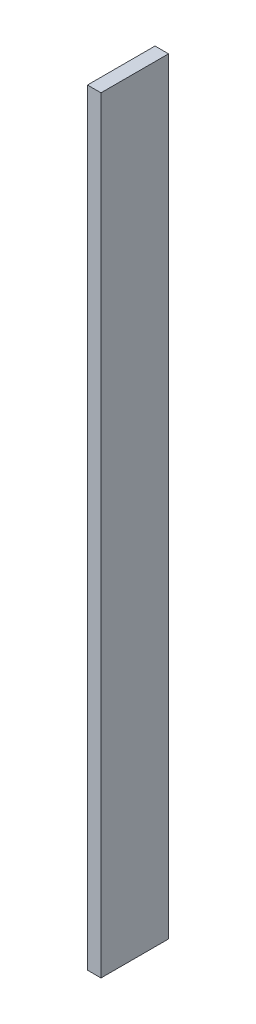
ISO-10303-21;
HEADER;
FILE_DESCRIPTION(('STEP AP214'),'2;1');
FILE_NAME('part.step','',(''),(''),'','','');
FILE_SCHEMA(('AUTOMOTIVE_DESIGN { 1 0 10303 214 1 1 1 1 }'));
ENDSEC;
DATA;
#1=APPLICATION_CONTEXT('core data for automotive mechanical design processes');
#2=APPLICATION_PROTOCOL_DEFINITION('international standard','automotive_design',2000,#1);
#3=PRODUCT_CONTEXT('',#1,'mechanical');
#4=PRODUCT('Part','Part','',(#3));
#5=PRODUCT_RELATED_PRODUCT_CATEGORY('part','',(#4));
#6=PRODUCT_DEFINITION_FORMATION('','',#4);
#7=PRODUCT_DEFINITION_CONTEXT('part definition',#1,'design');
#8=PRODUCT_DEFINITION('design','',#6,#7);
#9=PRODUCT_DEFINITION_SHAPE('','',#8);
#10=(LENGTH_UNIT() NAMED_UNIT(*) SI_UNIT(.MILLI.,.METRE.));
#11=(NAMED_UNIT(*) PLANE_ANGLE_UNIT() SI_UNIT($,.RADIAN.));
#12=(NAMED_UNIT(*) SI_UNIT($,.STERADIAN.) SOLID_ANGLE_UNIT());
#13=UNCERTAINTY_MEASURE_WITH_UNIT(LENGTH_MEASURE(1.E-05),#10,'distance_accuracy_value','');
#14=(GEOMETRIC_REPRESENTATION_CONTEXT(3) GLOBAL_UNCERTAINTY_ASSIGNED_CONTEXT((#13)) GLOBAL_UNIT_ASSIGNED_CONTEXT((#10,
#11,#12)) REPRESENTATION_CONTEXT('',''));
#15=CARTESIAN_POINT('',(0.,0.,0.));
#16=DIRECTION('',(0.,0.,1.));
#17=DIRECTION('',(1.,0.,0.));
#18=AXIS2_PLACEMENT_3D('',#15,#16,#17);
#19=CARTESIAN_POINT('',(-52.4875591164432,-34.0495234631935,0.));
#20=DIRECTION('',(0.,0.,-1.));
#21=DIRECTION('',(0.707106781186549,0.707106781186547,0.));
#22=AXIS2_PLACEMENT_3D('',#19,#20,#21);
#23=PLANE('',#22);
#24=DIRECTION('',(0.,-1.,0.));
#25=VECTOR('',#24,1.);
#26=CARTESIAN_POINT('',(-54.7219136914939,-33.4553943449556,0.));
#27=LINE('',#26,#25);
#28=CARTESIAN_POINT('',(-54.7219136914939,21.7746056550446,0.));
#29=VERTEX_POINT('',#28);
#30=CARTESIAN_POINT('',(-54.7219136914938,-91.7253943449556,0.));
#31=VERTEX_POINT('',#30);
#32=EDGE_CURVE('E51',#29,#31,#27,.T.);
#33=ORIENTED_EDGE('',*,*,#32,.F.);
#34=DIRECTION('',(1.,0.,0.));
#35=VECTOR('',#34,1.);
#36=CARTESIAN_POINT('',(-54.7219136914939,21.7746056550446,0.));
#37=LINE('',#36,#35);
#38=CARTESIAN_POINT('',(-52.7218736914939,21.7746056550446,0.));
#39=VERTEX_POINT('',#38);
#40=EDGE_CURVE('E109',#29,#39,#37,.T.);
#41=ORIENTED_EDGE('',*,*,#40,.T.);
#42=DIRECTION('',(0.,-1.,0.));
#43=VECTOR('',#42,1.);
#44=CARTESIAN_POINT('',(-52.7218736914939,-33.4553943449556,0.));
#45=LINE('',#44,#43);
#46=CARTESIAN_POINT('',(-52.7218736914938,-91.7253943449555,0.));
#47=VERTEX_POINT('',#46);
#48=EDGE_CURVE('E77',#39,#47,#45,.T.);
#49=ORIENTED_EDGE('',*,*,#48,.T.);
#50=DIRECTION('',(-1.,0.,0.));
#51=VECTOR('',#50,1.);
#52=CARTESIAN_POINT('',(-52.7218736914938,-91.7253943449555,0.));
#53=LINE('',#52,#51);
#54=EDGE_CURVE('E102',#47,#31,#53,.T.);
#55=ORIENTED_EDGE('',*,*,#54,.T.);
#56=EDGE_LOOP('',(#33,#41,#49,#55));
#57=FACE_BOUND('',#56,.T.);
#58=ADVANCED_FACE('F47',(#57),#23,.T.);
#59=CARTESIAN_POINT('',(-51.3561882665447,-57.2611852267176,10.));
#60=DIRECTION('',(0.,0.,1.));
#61=DIRECTION('',(-0.707106781186549,-0.707106781186547,0.));
#62=AXIS2_PLACEMENT_3D('',#59,#60,#61);
#63=PLANE('',#62);
#64=DIRECTION('',(0.,-1.,0.));
#65=VECTOR('',#64,1.);
#66=CARTESIAN_POINT('',(-54.7219136914939,-33.4553943449556,10.));
#67=LINE('',#66,#65);
#68=CARTESIAN_POINT('',(-54.7219136914939,21.7746056550446,10.));
#69=VERTEX_POINT('',#68);
#70=CARTESIAN_POINT('',(-54.7219136914938,-91.7253943449556,10.));
#71=VERTEX_POINT('',#70);
#72=EDGE_CURVE('E12',#69,#71,#67,.T.);
#73=ORIENTED_EDGE('',*,*,#72,.T.);
#74=DIRECTION('',(-1.,0.,0.));
#75=VECTOR('',#74,1.);
#76=CARTESIAN_POINT('',(-52.7218736914938,-91.7253943449555,10.));
#77=LINE('',#76,#75);
#78=CARTESIAN_POINT('',(-52.7218736914938,-91.7253943449555,10.));
#79=VERTEX_POINT('',#78);
#80=EDGE_CURVE('E100',#79,#71,#77,.T.);
#81=ORIENTED_EDGE('',*,*,#80,.F.);
#82=DIRECTION('',(0.,-1.,0.));
#83=VECTOR('',#82,1.);
#84=CARTESIAN_POINT('',(-52.7218736914939,-33.4553943449556,10.));
#85=LINE('',#84,#83);
#86=CARTESIAN_POINT('',(-52.7218736914939,21.7746056550446,10.));
#87=VERTEX_POINT('',#86);
#88=EDGE_CURVE('E57',#87,#79,#85,.T.);
#89=ORIENTED_EDGE('',*,*,#88,.F.);
#90=DIRECTION('',(1.,0.,0.));
#91=VECTOR('',#90,1.);
#92=CARTESIAN_POINT('',(-54.7219136914939,21.7746056550446,10.));
#93=LINE('',#92,#91);
#94=EDGE_CURVE('E115',#69,#87,#93,.T.);
#95=ORIENTED_EDGE('',*,*,#94,.F.);
#96=EDGE_LOOP('',(#73,#81,#89,#95));
#97=FACE_BOUND('',#96,.T.);
#98=ADVANCED_FACE('F105',(#97),#63,.T.);
#99=CARTESIAN_POINT('',(-52.7218736914939,21.7746056550446,10.));
#100=DIRECTION('',(1.,0.,0.));
#101=DIRECTION('',(0.,0.,-1.));
#102=AXIS2_PLACEMENT_3D('',#99,#100,#101);
#103=PLANE('',#102);
#104=ORIENTED_EDGE('',*,*,#48,.F.);
#105=DIRECTION('',(0.,0.,-1.));
#106=VECTOR('',#105,1.);
#107=CARTESIAN_POINT('',(-52.7218736914939,21.7746056550446,10.));
#108=LINE('',#107,#106);
#109=EDGE_CURVE('E94',#87,#39,#108,.T.);
#110=ORIENTED_EDGE('',*,*,#109,.F.);
#111=ORIENTED_EDGE('',*,*,#88,.T.);
#112=DIRECTION('',(0.,0.,-1.));
#113=VECTOR('',#112,1.);
#114=CARTESIAN_POINT('',(-52.7218736914938,-91.7253943449555,10.));
#115=LINE('',#114,#113);
#116=EDGE_CURVE('E92',#79,#47,#115,.T.);
#117=ORIENTED_EDGE('',*,*,#116,.T.);
#118=EDGE_LOOP('',(#104,#110,#111,#117));
#119=FACE_BOUND('',#118,.T.);
#120=ADVANCED_FACE('F49',(#119),#103,.T.);
#121=CARTESIAN_POINT('',(-54.7219136914939,-33.4553943449556,10.));
#122=DIRECTION('',(1.,0.,0.));
#123=DIRECTION('',(0.,1.,0.));
#124=AXIS2_PLACEMENT_3D('',#121,#122,#123);
#125=PLANE('',#124);
#126=ORIENTED_EDGE('',*,*,#32,.T.);
#127=DIRECTION('',(0.,0.,-1.));
#128=VECTOR('',#127,1.);
#129=CARTESIAN_POINT('',(-54.7219136914938,-91.7253943449556,10.));
#130=LINE('',#129,#128);
#131=EDGE_CURVE('E103',#71,#31,#130,.T.);
#132=ORIENTED_EDGE('',*,*,#131,.F.);
#133=ORIENTED_EDGE('',*,*,#72,.F.);
#134=DIRECTION('',(0.,0.,-1.));
#135=VECTOR('',#134,1.);
#136=CARTESIAN_POINT('',(-54.7219136914939,21.7746056550446,10.));
#137=LINE('',#136,#135);
#138=EDGE_CURVE('E112',#69,#29,#137,.T.);
#139=ORIENTED_EDGE('',*,*,#138,.T.);
#140=EDGE_LOOP('',(#126,#132,#133,#139));
#141=FACE_BOUND('',#140,.T.);
#142=ADVANCED_FACE('F120',(#141),#125,.F.);
#143=CARTESIAN_POINT('',(-54.7219136914939,21.7746056550446,10.));
#144=DIRECTION('',(0.,1.,0.));
#145=DIRECTION('',(0.,0.,1.));
#146=AXIS2_PLACEMENT_3D('',#143,#144,#145);
#147=PLANE('',#146);
#148=ORIENTED_EDGE('',*,*,#40,.F.);
#149=ORIENTED_EDGE('',*,*,#138,.F.);
#150=ORIENTED_EDGE('',*,*,#94,.T.);
#151=ORIENTED_EDGE('',*,*,#109,.T.);
#152=EDGE_LOOP('',(#148,#149,#150,#151));
#153=FACE_BOUND('',#152,.T.);
#154=ADVANCED_FACE('F119',(#153),#147,.T.);
#155=CARTESIAN_POINT('',(-52.7218736914938,-91.7253943449555,10.));
#156=DIRECTION('',(0.,-1.,0.));
#157=DIRECTION('',(1.,0.,0.));
#158=AXIS2_PLACEMENT_3D('',#155,#156,#157);
#159=PLANE('',#158);
#160=ORIENTED_EDGE('',*,*,#54,.F.);
#161=ORIENTED_EDGE('',*,*,#116,.F.);
#162=ORIENTED_EDGE('',*,*,#80,.T.);
#163=ORIENTED_EDGE('',*,*,#131,.T.);
#164=EDGE_LOOP('',(#160,#161,#162,#163));
#165=FACE_BOUND('',#164,.T.);
#166=ADVANCED_FACE('F99',(#165),#159,.T.);
#167=CLOSED_SHELL('',(#58,#98,#120,#142,#154,#166));
#168=MANIFOLD_SOLID_BREP('B2',#167);
#169=ADVANCED_BREP_SHAPE_REPRESENTATION('',(#18,#168),#14);
#170=SHAPE_DEFINITION_REPRESENTATION(#9,#169);
ENDSEC;
END-ISO-10303-21;
